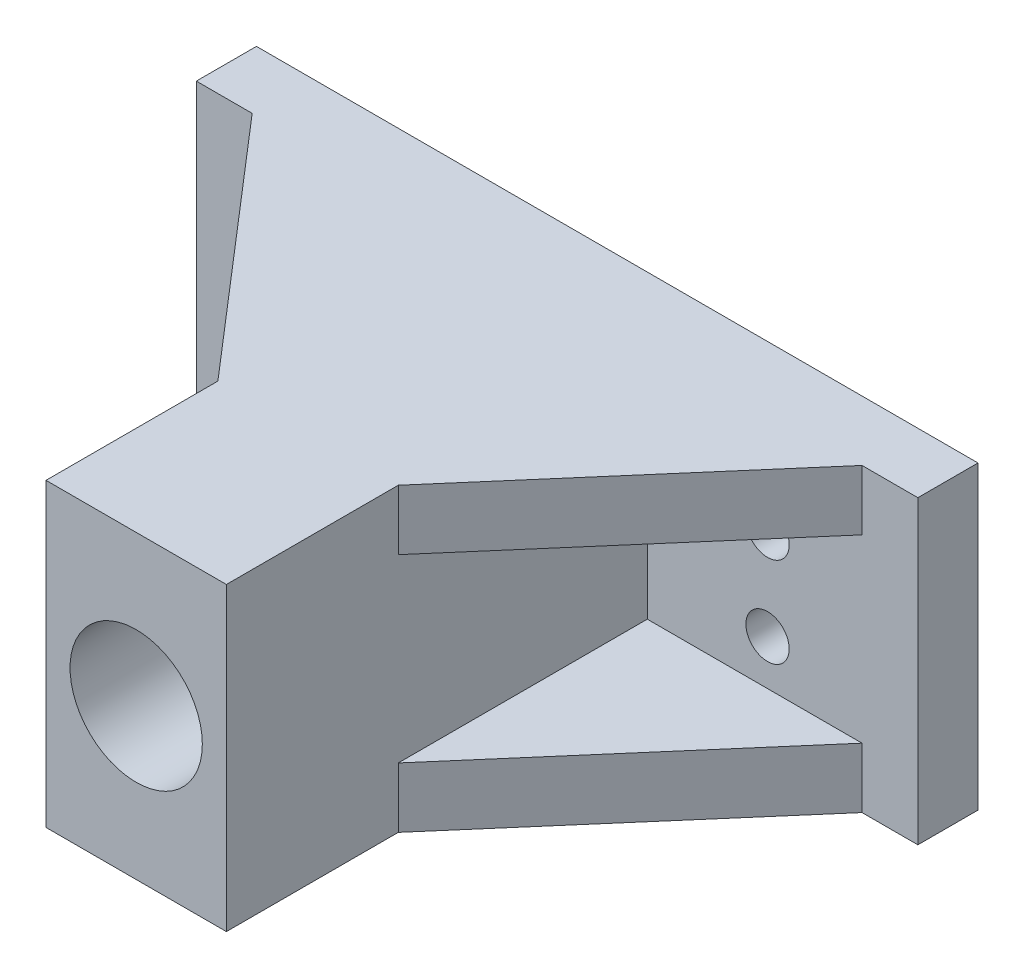
ISO-10303-21;
HEADER;
FILE_DESCRIPTION(('STEP AP214'),'2;1');
FILE_NAME('part.step','',(''),(''),'','','');
FILE_SCHEMA(('AUTOMOTIVE_DESIGN { 1 0 10303 214 1 1 1 1 }'));
ENDSEC;
DATA;
#1=APPLICATION_CONTEXT('core data for automotive mechanical design processes');
#2=APPLICATION_PROTOCOL_DEFINITION('international standard','automotive_design',2000,#1);
#3=PRODUCT_CONTEXT('',#1,'mechanical');
#4=PRODUCT('Part','Part','',(#3));
#5=PRODUCT_RELATED_PRODUCT_CATEGORY('part','',(#4));
#6=PRODUCT_DEFINITION_FORMATION('','',#4);
#7=PRODUCT_DEFINITION_CONTEXT('part definition',#1,'design');
#8=PRODUCT_DEFINITION('design','',#6,#7);
#9=PRODUCT_DEFINITION_SHAPE('','',#8);
#10=(LENGTH_UNIT() NAMED_UNIT(*) SI_UNIT(.MILLI.,.METRE.));
#11=(NAMED_UNIT(*) PLANE_ANGLE_UNIT() SI_UNIT($,.RADIAN.));
#12=(NAMED_UNIT(*) SI_UNIT($,.STERADIAN.) SOLID_ANGLE_UNIT());
#13=UNCERTAINTY_MEASURE_WITH_UNIT(LENGTH_MEASURE(1.E-05),#10,'distance_accuracy_value','');
#14=(GEOMETRIC_REPRESENTATION_CONTEXT(3) GLOBAL_UNCERTAINTY_ASSIGNED_CONTEXT((#13)) GLOBAL_UNIT_ASSIGNED_CONTEXT((#10,
#11,#12)) REPRESENTATION_CONTEXT('',''));
#15=CARTESIAN_POINT('',(0.,0.,0.));
#16=DIRECTION('',(0.,0.,1.));
#17=DIRECTION('',(1.,0.,0.));
#18=AXIS2_PLACEMENT_3D('',#15,#16,#17);
#19=CARTESIAN_POINT('',(0.,0.,5.));
#20=DIRECTION('',(0.,0.,1.));
#21=DIRECTION('',(1.,0.,0.));
#22=AXIS2_PLACEMENT_3D('',#19,#20,#21);
#23=PLANE('',#22);
#24=CARTESIAN_POINT('',(17.5,-3.75,5.));
#25=DIRECTION('',(0.,0.,1.));
#26=DIRECTION('',(1.,0.,0.));
#27=AXIS2_PLACEMENT_3D('',#24,#25,#26);
#28=CIRCLE('',#27,1.8);
#29=CARTESIAN_POINT('',(19.3,-3.75,5.));
#30=VERTEX_POINT('',#29);
#31=EDGE_CURVE('E196',#30,#30,#28,.T.);
#32=ORIENTED_EDGE('',*,*,#31,.F.);
#33=EDGE_LOOP('',(#32));
#34=FACE_BOUND('',#33,.T.);
#35=CARTESIAN_POINT('',(17.5,3.75,5.));
#36=DIRECTION('',(0.,0.,1.));
#37=DIRECTION('',(-1.,0.,0.));
#38=AXIS2_PLACEMENT_3D('',#35,#36,#37);
#39=CIRCLE('',#38,1.8);
#40=CARTESIAN_POINT('',(15.7,3.75,5.));
#41=VERTEX_POINT('',#40);
#42=EDGE_CURVE('E185',#41,#41,#39,.T.);
#43=ORIENTED_EDGE('',*,*,#42,.F.);
#44=EDGE_LOOP('',(#43));
#45=FACE_BOUND('',#44,.T.);
#46=DIRECTION('',(0.,1.,0.));
#47=VECTOR('',#46,1.);
#48=CARTESIAN_POINT('',(25.3552316545314,0.,5.));
#49=LINE('',#48,#47);
#50=CARTESIAN_POINT('',(25.3552316545314,-12.5,5.00000000000001));
#51=VERTEX_POINT('',#50);
#52=CARTESIAN_POINT('',(25.3552316545314,-7.5,5.));
#53=VERTEX_POINT('',#52);
#54=EDGE_CURVE('E219',#51,#53,#49,.T.);
#55=ORIENTED_EDGE('',*,*,#54,.F.);
#56=DIRECTION('',(1.,0.,0.));
#57=VECTOR('',#56,1.);
#58=CARTESIAN_POINT('',(-30.,-12.5,5.));
#59=LINE('',#58,#57);
#60=CARTESIAN_POINT('',(30.,-12.5,5.));
#61=VERTEX_POINT('',#60);
#62=EDGE_CURVE('E270',#51,#61,#59,.T.);
#63=ORIENTED_EDGE('',*,*,#62,.T.);
#64=DIRECTION('',(0.,1.,0.));
#65=VECTOR('',#64,1.);
#66=CARTESIAN_POINT('',(30.,7.50000000000001,5.));
#67=LINE('',#66,#65);
#68=CARTESIAN_POINT('',(30.,12.5,5.));
#69=VERTEX_POINT('',#68);
#70=EDGE_CURVE('E291',#61,#69,#67,.T.);
#71=ORIENTED_EDGE('',*,*,#70,.T.);
#72=DIRECTION('',(-1.,0.,0.));
#73=VECTOR('',#72,1.);
#74=CARTESIAN_POINT('',(-30.,12.5,5.));
#75=LINE('',#74,#73);
#76=CARTESIAN_POINT('',(25.3552316545314,12.5,5.00000000000001));
#77=VERTEX_POINT('',#76);
#78=EDGE_CURVE('E286',#69,#77,#75,.T.);
#79=ORIENTED_EDGE('',*,*,#78,.T.);
#80=DIRECTION('',(0.,-1.,0.));
#81=VECTOR('',#80,1.);
#82=CARTESIAN_POINT('',(25.3552316545314,0.,5.));
#83=LINE('',#82,#81);
#84=CARTESIAN_POINT('',(25.3552316545314,7.5,5.));
#85=VERTEX_POINT('',#84);
#86=EDGE_CURVE('E235',#85,#77,#83,.F.);
#87=ORIENTED_EDGE('',*,*,#86,.F.);
#88=DIRECTION('',(-1.,0.,0.));
#89=VECTOR('',#88,1.);
#90=CARTESIAN_POINT('',(0.,7.5,5.));
#91=LINE('',#90,#89);
#92=CARTESIAN_POINT('',(7.5,7.5,5.));
#93=VERTEX_POINT('',#92);
#94=EDGE_CURVE('E230',#85,#93,#91,.T.);
#95=ORIENTED_EDGE('',*,*,#94,.T.);
#96=DIRECTION('',(0.,1.,0.));
#97=VECTOR('',#96,1.);
#98=CARTESIAN_POINT('',(7.5,7.5,5.));
#99=LINE('',#98,#97);
#100=CARTESIAN_POINT('',(7.5,-7.5,5.));
#101=VERTEX_POINT('',#100);
#102=EDGE_CURVE('E43',#101,#93,#99,.T.);
#103=ORIENTED_EDGE('',*,*,#102,.F.);
#104=DIRECTION('',(1.,0.,0.));
#105=VECTOR('',#104,1.);
#106=CARTESIAN_POINT('',(0.,-7.5,5.));
#107=LINE('',#106,#105);
#108=EDGE_CURVE('E50',#101,#53,#107,.T.);
#109=ORIENTED_EDGE('',*,*,#108,.T.);
#110=EDGE_LOOP('',(#55,#63,#71,#79,#87,#95,#103,#109));
#111=FACE_BOUND('',#110,.T.);
#112=ADVANCED_FACE('F35',(#34,#45,#111),#23,.T.);
#113=CARTESIAN_POINT('',(-17.5,-3.75,5.));
#114=DIRECTION('',(0.,0.,1.));
#115=DIRECTION('',(-1.,0.,0.));
#116=AXIS2_PLACEMENT_3D('',#113,#114,#115);
#117=CIRCLE('',#116,1.8);
#118=CARTESIAN_POINT('',(-19.3,-3.75,5.));
#119=VERTEX_POINT('',#118);
#120=EDGE_CURVE('E190',#119,#119,#117,.T.);
#121=ORIENTED_EDGE('',*,*,#120,.F.);
#122=EDGE_LOOP('',(#121));
#123=FACE_BOUND('',#122,.T.);
#124=CARTESIAN_POINT('',(-17.5,3.75,5.));
#125=DIRECTION('',(0.,0.,1.));
#126=DIRECTION('',(1.,0.,0.));
#127=AXIS2_PLACEMENT_3D('',#124,#125,#126);
#128=CIRCLE('',#127,1.8);
#129=CARTESIAN_POINT('',(-15.7,3.75,5.));
#130=VERTEX_POINT('',#129);
#131=EDGE_CURVE('E189',#130,#130,#128,.T.);
#132=ORIENTED_EDGE('',*,*,#131,.F.);
#133=EDGE_LOOP('',(#132));
#134=FACE_BOUND('',#133,.T.);
#135=DIRECTION('',(0.,1.,0.));
#136=VECTOR('',#135,1.);
#137=CARTESIAN_POINT('',(-25.3552316545314,0.,5.));
#138=LINE('',#137,#136);
#139=CARTESIAN_POINT('',(-25.3552316545314,-7.5,5.));
#140=VERTEX_POINT('',#139);
#141=CARTESIAN_POINT('',(-25.3552316545314,-12.5,5.));
#142=VERTEX_POINT('',#141);
#143=EDGE_CURVE('E245',#140,#142,#138,.F.);
#144=ORIENTED_EDGE('',*,*,#143,.F.);
#145=DIRECTION('',(1.,0.,0.));
#146=VECTOR('',#145,1.);
#147=CARTESIAN_POINT('',(0.,-7.5,5.));
#148=LINE('',#147,#146);
#149=CARTESIAN_POINT('',(-7.5,-7.5,5.));
#150=VERTEX_POINT('',#149);
#151=EDGE_CURVE('E249',#140,#150,#148,.T.);
#152=ORIENTED_EDGE('',*,*,#151,.T.);
#153=DIRECTION('',(0.,-1.,0.));
#154=VECTOR('',#153,1.);
#155=CARTESIAN_POINT('',(-7.5,7.5,5.));
#156=LINE('',#155,#154);
#157=CARTESIAN_POINT('',(-7.5,7.5,5.));
#158=VERTEX_POINT('',#157);
#159=EDGE_CURVE('E300',#158,#150,#156,.T.);
#160=ORIENTED_EDGE('',*,*,#159,.F.);
#161=DIRECTION('',(-1.,0.,0.));
#162=VECTOR('',#161,1.);
#163=CARTESIAN_POINT('',(0.,7.5,5.));
#164=LINE('',#163,#162);
#165=CARTESIAN_POINT('',(-25.3552316545314,7.5,5.));
#166=VERTEX_POINT('',#165);
#167=EDGE_CURVE('E264',#158,#166,#164,.T.);
#168=ORIENTED_EDGE('',*,*,#167,.T.);
#169=DIRECTION('',(0.,-1.,0.));
#170=VECTOR('',#169,1.);
#171=CARTESIAN_POINT('',(-25.3552316545314,0.,5.));
#172=LINE('',#171,#170);
#173=CARTESIAN_POINT('',(-25.3552316545314,12.5,5.));
#174=VERTEX_POINT('',#173);
#175=EDGE_CURVE('E258',#174,#166,#172,.T.);
#176=ORIENTED_EDGE('',*,*,#175,.F.);
#177=CARTESIAN_POINT('',(-30.,12.5,5.));
#178=VERTEX_POINT('',#177);
#179=EDGE_CURVE('E280',#174,#178,#75,.T.);
#180=ORIENTED_EDGE('',*,*,#179,.T.);
#181=DIRECTION('',(0.,-1.,0.));
#182=VECTOR('',#181,1.);
#183=CARTESIAN_POINT('',(-30.,7.5,5.));
#184=LINE('',#183,#182);
#185=CARTESIAN_POINT('',(-30.,-12.5,5.));
#186=VERTEX_POINT('',#185);
#187=EDGE_CURVE('E296',#178,#186,#184,.T.);
#188=ORIENTED_EDGE('',*,*,#187,.T.);
#189=EDGE_CURVE('E274',#186,#142,#59,.T.);
#190=ORIENTED_EDGE('',*,*,#189,.T.);
#191=EDGE_LOOP('',(#144,#152,#160,#168,#176,#180,#188,#190));
#192=FACE_BOUND('',#191,.T.);
#193=ADVANCED_FACE('F333',(#123,#134,#192),#23,.T.);
#194=CARTESIAN_POINT('',(0.,0.,0.));
#195=DIRECTION('',(0.,0.,1.));
#196=DIRECTION('',(1.,0.,0.));
#197=AXIS2_PLACEMENT_3D('',#194,#195,#196);
#198=PLANE('',#197);
#199=CARTESIAN_POINT('',(-17.5,-3.75,0.));
#200=DIRECTION('',(0.,0.,1.));
#201=DIRECTION('',(-1.,0.,0.));
#202=AXIS2_PLACEMENT_3D('',#199,#200,#201);
#203=CIRCLE('',#202,1.8);
#204=CARTESIAN_POINT('',(-19.3,-3.75,0.));
#205=VERTEX_POINT('',#204);
#206=EDGE_CURVE('E186',#205,#205,#203,.T.);
#207=ORIENTED_EDGE('',*,*,#206,.T.);
#208=EDGE_LOOP('',(#207));
#209=FACE_BOUND('',#208,.T.);
#210=CARTESIAN_POINT('',(17.5,-3.75,0.));
#211=DIRECTION('',(0.,0.,1.));
#212=DIRECTION('',(1.,0.,0.));
#213=AXIS2_PLACEMENT_3D('',#210,#211,#212);
#214=CIRCLE('',#213,1.8);
#215=CARTESIAN_POINT('',(19.3,-3.75,0.));
#216=VERTEX_POINT('',#215);
#217=EDGE_CURVE('E193',#216,#216,#214,.T.);
#218=ORIENTED_EDGE('',*,*,#217,.T.);
#219=EDGE_LOOP('',(#218));
#220=FACE_BOUND('',#219,.T.);
#221=CARTESIAN_POINT('',(17.5,3.75,0.));
#222=DIRECTION('',(0.,0.,1.));
#223=DIRECTION('',(-1.,0.,0.));
#224=AXIS2_PLACEMENT_3D('',#221,#222,#223);
#225=CIRCLE('',#224,1.8);
#226=CARTESIAN_POINT('',(15.7,3.75,0.));
#227=VERTEX_POINT('',#226);
#228=EDGE_CURVE('E199',#227,#227,#225,.T.);
#229=ORIENTED_EDGE('',*,*,#228,.T.);
#230=EDGE_LOOP('',(#229));
#231=FACE_BOUND('',#230,.T.);
#232=CARTESIAN_POINT('',(-17.5,3.75,0.));
#233=DIRECTION('',(0.,0.,1.));
#234=DIRECTION('',(1.,0.,0.));
#235=AXIS2_PLACEMENT_3D('',#232,#233,#234);
#236=CIRCLE('',#235,1.8);
#237=CARTESIAN_POINT('',(-15.7,3.75,0.));
#238=VERTEX_POINT('',#237);
#239=EDGE_CURVE('E204',#238,#238,#236,.T.);
#240=ORIENTED_EDGE('',*,*,#239,.T.);
#241=EDGE_LOOP('',(#240));
#242=FACE_BOUND('',#241,.T.);
#243=DIRECTION('',(0.,1.,0.));
#244=VECTOR('',#243,1.);
#245=CARTESIAN_POINT('',(30.,7.50000000000001,0.));
#246=LINE('',#245,#244);
#247=CARTESIAN_POINT('',(30.,-12.5,0.));
#248=VERTEX_POINT('',#247);
#249=CARTESIAN_POINT('',(30.,12.5,0.));
#250=VERTEX_POINT('',#249);
#251=EDGE_CURVE('E294',#248,#250,#246,.T.);
#252=ORIENTED_EDGE('',*,*,#251,.F.);
#253=DIRECTION('',(1.,0.,0.));
#254=VECTOR('',#253,1.);
#255=CARTESIAN_POINT('',(-30.,-12.5,0.));
#256=LINE('',#255,#254);
#257=CARTESIAN_POINT('',(-30.,-12.5,0.));
#258=VERTEX_POINT('',#257);
#259=EDGE_CURVE('E271',#258,#248,#256,.T.);
#260=ORIENTED_EDGE('',*,*,#259,.F.);
#261=DIRECTION('',(0.,-1.,0.));
#262=VECTOR('',#261,1.);
#263=CARTESIAN_POINT('',(-30.,7.5,0.));
#264=LINE('',#263,#262);
#265=CARTESIAN_POINT('',(-30.,12.5,0.));
#266=VERTEX_POINT('',#265);
#267=EDGE_CURVE('E298',#266,#258,#264,.T.);
#268=ORIENTED_EDGE('',*,*,#267,.F.);
#269=DIRECTION('',(-1.,0.,0.));
#270=VECTOR('',#269,1.);
#271=CARTESIAN_POINT('',(-30.,12.5,0.));
#272=LINE('',#271,#270);
#273=EDGE_CURVE('E283',#250,#266,#272,.T.);
#274=ORIENTED_EDGE('',*,*,#273,.F.);
#275=EDGE_LOOP('',(#252,#260,#268,#274));
#276=FACE_BOUND('',#275,.T.);
#277=CARTESIAN_POINT('',(0.,0.,0.));
#278=DIRECTION('',(0.,0.,1.));
#279=DIRECTION('',(1.,0.,0.));
#280=AXIS2_PLACEMENT_3D('',#277,#278,#279);
#281=CIRCLE('',#280,5.5);
#282=CARTESIAN_POINT('',(5.5,0.,0.));
#283=VERTEX_POINT('',#282);
#284=EDGE_CURVE('E11',#283,#283,#281,.T.);
#285=ORIENTED_EDGE('',*,*,#284,.T.);
#286=EDGE_LOOP('',(#285));
#287=FACE_BOUND('',#286,.T.);
#288=ADVANCED_FACE('F37',(#209,#220,#231,#242,#276,#287),#198,.F.);
#289=CARTESIAN_POINT('',(0.,0.,0.));
#290=DIRECTION('',(0.,0.,1.));
#291=DIRECTION('',(1.,0.,0.));
#292=AXIS2_PLACEMENT_3D('',#289,#290,#291);
#293=CYLINDRICAL_SURFACE('',#292,5.5);
#294=ORIENTED_EDGE('',*,*,#284,.F.);
#295=EDGE_LOOP('',(#294));
#296=FACE_BOUND('',#295,.T.);
#297=CARTESIAN_POINT('',(0.,0.,40.));
#298=DIRECTION('',(0.,0.,1.));
#299=DIRECTION('',(1.,0.,0.));
#300=AXIS2_PLACEMENT_3D('',#297,#298,#299);
#301=CIRCLE('',#300,5.5);
#302=CARTESIAN_POINT('',(5.5,0.,40.));
#303=VERTEX_POINT('',#302);
#304=EDGE_CURVE('E178',#303,#303,#301,.T.);
#305=ORIENTED_EDGE('',*,*,#304,.T.);
#306=EDGE_LOOP('',(#305));
#307=FACE_BOUND('',#306,.T.);
#308=ADVANCED_FACE('F376',(#296,#307),#293,.F.);
#309=CARTESIAN_POINT('',(-7.5,7.5,30.));
#310=DIRECTION('',(1.,0.,0.));
#311=DIRECTION('',(0.,1.,0.));
#312=AXIS2_PLACEMENT_3D('',#309,#310,#311);
#313=PLANE('',#312);
#314=DIRECTION('',(0.,0.,-1.));
#315=VECTOR('',#314,1.);
#316=CARTESIAN_POINT('',(-7.5,-12.5,45.8113883008419));
#317=LINE('',#316,#315);
#318=CARTESIAN_POINT('',(-7.5,-12.5,40.));
#319=VERTEX_POINT('',#318);
#320=CARTESIAN_POINT('',(-7.49999999999998,-12.5,25.7076023988971));
#321=VERTEX_POINT('',#320);
#322=EDGE_CURVE('E161',#319,#321,#317,.T.);
#323=ORIENTED_EDGE('',*,*,#322,.F.);
#324=DIRECTION('',(0.,-1.,0.));
#325=VECTOR('',#324,1.);
#326=CARTESIAN_POINT('',(-7.5,12.5,40.));
#327=LINE('',#326,#325);
#328=CARTESIAN_POINT('',(-7.5,12.5,40.));
#329=VERTEX_POINT('',#328);
#330=EDGE_CURVE('E164',#329,#319,#327,.T.);
#331=ORIENTED_EDGE('',*,*,#330,.F.);
#332=DIRECTION('',(0.,0.,-1.));
#333=VECTOR('',#332,1.);
#334=CARTESIAN_POINT('',(-7.5,12.5,45.8113883008419));
#335=LINE('',#334,#333);
#336=CARTESIAN_POINT('',(-7.49999999999999,12.5,25.7076023988971));
#337=VERTEX_POINT('',#336);
#338=EDGE_CURVE('E149',#329,#337,#335,.T.);
#339=ORIENTED_EDGE('',*,*,#338,.T.);
#340=DIRECTION('',(0.,-1.,0.));
#341=VECTOR('',#340,1.);
#342=CARTESIAN_POINT('',(-7.5,7.5,25.7076023988971));
#343=LINE('',#342,#341);
#344=CARTESIAN_POINT('',(-7.5,7.5,25.7076023988971));
#345=VERTEX_POINT('',#344);
#346=EDGE_CURVE('E254',#337,#345,#343,.T.);
#347=ORIENTED_EDGE('',*,*,#346,.T.);
#348=DIRECTION('',(0.,0.,1.));
#349=VECTOR('',#348,1.);
#350=CARTESIAN_POINT('',(-7.5,7.5,30.));
#351=LINE('',#350,#349);
#352=EDGE_CURVE('E261',#158,#345,#351,.T.);
#353=ORIENTED_EDGE('',*,*,#352,.F.);
#354=ORIENTED_EDGE('',*,*,#159,.T.);
#355=DIRECTION('',(0.,0.,-1.));
#356=VECTOR('',#355,1.);
#357=CARTESIAN_POINT('',(-7.5,-7.5,30.));
#358=LINE('',#357,#356);
#359=CARTESIAN_POINT('',(-7.5,-7.5,25.7076023988971));
#360=VERTEX_POINT('',#359);
#361=EDGE_CURVE('E247',#360,#150,#358,.T.);
#362=ORIENTED_EDGE('',*,*,#361,.F.);
#363=DIRECTION('',(0.,1.,0.));
#364=VECTOR('',#363,1.);
#365=CARTESIAN_POINT('',(-7.5,7.5,25.7076023988971));
#366=LINE('',#365,#364);
#367=EDGE_CURVE('E241',#360,#321,#366,.F.);
#368=ORIENTED_EDGE('',*,*,#367,.T.);
#369=EDGE_LOOP('',(#323,#331,#339,#347,#353,#354,#362,#368));
#370=FACE_BOUND('',#369,.T.);
#371=ADVANCED_FACE('F165',(#370),#313,.F.);
#372=CARTESIAN_POINT('',(7.5,7.5,30.));
#373=DIRECTION('',(-1.,0.,0.));
#374=DIRECTION('',(0.,0.,1.));
#375=AXIS2_PLACEMENT_3D('',#372,#373,#374);
#376=PLANE('',#375);
#377=DIRECTION('',(0.,0.,-1.));
#378=VECTOR('',#377,1.);
#379=CARTESIAN_POINT('',(7.5,-12.5,45.8113883008419));
#380=LINE('',#379,#378);
#381=CARTESIAN_POINT('',(7.5,-12.5,40.));
#382=VERTEX_POINT('',#381);
#383=CARTESIAN_POINT('',(7.49999999999999,-12.5,25.7076023988971));
#384=VERTEX_POINT('',#383);
#385=EDGE_CURVE('E266',#382,#384,#380,.T.);
#386=ORIENTED_EDGE('',*,*,#385,.T.);
#387=DIRECTION('',(0.,1.,0.));
#388=VECTOR('',#387,1.);
#389=CARTESIAN_POINT('',(7.5,7.5,25.7076023988971));
#390=LINE('',#389,#388);
#391=CARTESIAN_POINT('',(7.5,-7.5,25.7076023988971));
#392=VERTEX_POINT('',#391);
#393=EDGE_CURVE('E58',#384,#392,#390,.T.);
#394=ORIENTED_EDGE('',*,*,#393,.T.);
#395=DIRECTION('',(0.,0.,1.));
#396=VECTOR('',#395,1.);
#397=CARTESIAN_POINT('',(7.5,-7.5,30.));
#398=LINE('',#397,#396);
#399=EDGE_CURVE('E213',#101,#392,#398,.T.);
#400=ORIENTED_EDGE('',*,*,#399,.F.);
#401=ORIENTED_EDGE('',*,*,#102,.T.);
#402=DIRECTION('',(0.,0.,-1.));
#403=VECTOR('',#402,1.);
#404=CARTESIAN_POINT('',(7.5,7.5,30.));
#405=LINE('',#404,#403);
#406=CARTESIAN_POINT('',(7.5,7.5,25.7076023988971));
#407=VERTEX_POINT('',#406);
#408=EDGE_CURVE('E225',#407,#93,#405,.T.);
#409=ORIENTED_EDGE('',*,*,#408,.F.);
#410=DIRECTION('',(0.,-1.,0.));
#411=VECTOR('',#410,1.);
#412=CARTESIAN_POINT('',(7.5,7.5,25.7076023988971));
#413=LINE('',#412,#411);
#414=CARTESIAN_POINT('',(7.49999999999999,12.5,25.7076023988971));
#415=VERTEX_POINT('',#414);
#416=EDGE_CURVE('E233',#407,#415,#413,.F.);
#417=ORIENTED_EDGE('',*,*,#416,.T.);
#418=DIRECTION('',(0.,0.,-1.));
#419=VECTOR('',#418,1.);
#420=CARTESIAN_POINT('',(7.5,12.5,45.8113883008419));
#421=LINE('',#420,#419);
#422=CARTESIAN_POINT('',(7.5,12.5,40.));
#423=VERTEX_POINT('',#422);
#424=EDGE_CURVE('E160',#423,#415,#421,.T.);
#425=ORIENTED_EDGE('',*,*,#424,.F.);
#426=DIRECTION('',(0.,1.,0.));
#427=VECTOR('',#426,1.);
#428=CARTESIAN_POINT('',(7.5,-12.5,40.));
#429=LINE('',#428,#427);
#430=EDGE_CURVE('E177',#382,#423,#429,.T.);
#431=ORIENTED_EDGE('',*,*,#430,.F.);
#432=EDGE_LOOP('',(#386,#394,#400,#401,#409,#417,#425,#431));
#433=FACE_BOUND('',#432,.T.);
#434=ADVANCED_FACE('F303',(#433),#376,.F.);
#435=CARTESIAN_POINT('',(-30.,7.5,0.));
#436=DIRECTION('',(-1.,0.,0.));
#437=DIRECTION('',(0.,0.,1.));
#438=AXIS2_PLACEMENT_3D('',#435,#436,#437);
#439=PLANE('',#438);
#440=DIRECTION('',(0.,0.,1.));
#441=VECTOR('',#440,1.);
#442=CARTESIAN_POINT('',(-30.,-12.5,0.));
#443=LINE('',#442,#441);
#444=EDGE_CURVE('E273',#258,#186,#443,.T.);
#445=ORIENTED_EDGE('',*,*,#444,.T.);
#446=ORIENTED_EDGE('',*,*,#187,.F.);
#447=DIRECTION('',(0.,0.,1.));
#448=VECTOR('',#447,1.);
#449=CARTESIAN_POINT('',(-30.,12.5,0.));
#450=LINE('',#449,#448);
#451=EDGE_CURVE('E288',#266,#178,#450,.T.);
#452=ORIENTED_EDGE('',*,*,#451,.F.);
#453=ORIENTED_EDGE('',*,*,#267,.T.);
#454=EDGE_LOOP('',(#445,#446,#452,#453));
#455=FACE_BOUND('',#454,.T.);
#456=ADVANCED_FACE('F328',(#455),#439,.T.);
#457=CARTESIAN_POINT('',(30.,7.50000000000001,0.));
#458=DIRECTION('',(1.,0.,0.));
#459=DIRECTION('',(0.,0.,-1.));
#460=AXIS2_PLACEMENT_3D('',#457,#458,#459);
#461=PLANE('',#460);
#462=ORIENTED_EDGE('',*,*,#251,.T.);
#463=DIRECTION('',(0.,0.,1.));
#464=VECTOR('',#463,1.);
#465=CARTESIAN_POINT('',(30.,12.5,0.));
#466=LINE('',#465,#464);
#467=EDGE_CURVE('E285',#250,#69,#466,.T.);
#468=ORIENTED_EDGE('',*,*,#467,.T.);
#469=ORIENTED_EDGE('',*,*,#70,.F.);
#470=DIRECTION('',(0.,0.,1.));
#471=VECTOR('',#470,1.);
#472=CARTESIAN_POINT('',(30.,-12.5,0.));
#473=LINE('',#472,#471);
#474=EDGE_CURVE('E277',#248,#61,#473,.T.);
#475=ORIENTED_EDGE('',*,*,#474,.F.);
#476=EDGE_LOOP('',(#462,#468,#469,#475));
#477=FACE_BOUND('',#476,.T.);
#478=ADVANCED_FACE('F319',(#477),#461,.T.);
#479=CARTESIAN_POINT('',(-30.,12.5,0.));
#480=DIRECTION('',(0.,1.,0.));
#481=DIRECTION('',(0.,0.,1.));
#482=AXIS2_PLACEMENT_3D('',#479,#480,#481);
#483=PLANE('',#482);
#484=ORIENTED_EDGE('',*,*,#424,.T.);
#485=DIRECTION('',(-0.653020400460944,0.,0.757340317546761));
#486=VECTOR('',#485,1.);
#487=CARTESIAN_POINT('',(25.3552316545314,12.5,5.));
#488=LINE('',#487,#486);
#489=EDGE_CURVE('E222',#77,#415,#488,.T.);
#490=ORIENTED_EDGE('',*,*,#489,.F.);
#491=ORIENTED_EDGE('',*,*,#78,.F.);
#492=ORIENTED_EDGE('',*,*,#467,.F.);
#493=ORIENTED_EDGE('',*,*,#273,.T.);
#494=ORIENTED_EDGE('',*,*,#451,.T.);
#495=ORIENTED_EDGE('',*,*,#179,.F.);
#496=DIRECTION('',(0.653020400460944,0.,0.757340317546761));
#497=VECTOR('',#496,1.);
#498=CARTESIAN_POINT('',(-25.3552316545314,12.5,5.));
#499=LINE('',#498,#497);
#500=EDGE_CURVE('E157',#174,#337,#499,.T.);
#501=ORIENTED_EDGE('',*,*,#500,.T.);
#502=ORIENTED_EDGE('',*,*,#338,.F.);
#503=DIRECTION('',(-1.,0.,0.));
#504=VECTOR('',#503,1.);
#505=CARTESIAN_POINT('',(7.5,12.5,40.));
#506=LINE('',#505,#504);
#507=EDGE_CURVE('E154',#423,#329,#506,.T.);
#508=ORIENTED_EDGE('',*,*,#507,.F.);
#509=EDGE_LOOP('',(#484,#490,#491,#492,#493,#494,#495,#501,#502,#508));
#510=FACE_BOUND('',#509,.T.);
#511=ADVANCED_FACE('F152',(#510),#483,.T.);
#512=CARTESIAN_POINT('',(-30.,-12.5,0.));
#513=DIRECTION('',(0.,-1.,0.));
#514=DIRECTION('',(1.,0.,0.));
#515=AXIS2_PLACEMENT_3D('',#512,#513,#514);
#516=PLANE('',#515);
#517=ORIENTED_EDGE('',*,*,#62,.F.);
#518=DIRECTION('',(-0.653020400460944,0.,0.757340317546761));
#519=VECTOR('',#518,1.);
#520=CARTESIAN_POINT('',(25.3552316545314,-12.5,5.));
#521=LINE('',#520,#519);
#522=EDGE_CURVE('E210',#51,#384,#521,.T.);
#523=ORIENTED_EDGE('',*,*,#522,.T.);
#524=ORIENTED_EDGE('',*,*,#385,.F.);
#525=DIRECTION('',(1.,0.,0.));
#526=VECTOR('',#525,1.);
#527=CARTESIAN_POINT('',(-7.5,-12.5,40.));
#528=LINE('',#527,#526);
#529=EDGE_CURVE('E171',#319,#382,#528,.T.);
#530=ORIENTED_EDGE('',*,*,#529,.F.);
#531=ORIENTED_EDGE('',*,*,#322,.T.);
#532=DIRECTION('',(0.653020400460944,0.,0.757340317546761));
#533=VECTOR('',#532,1.);
#534=CARTESIAN_POINT('',(-25.3552316545314,-12.5,5.));
#535=LINE('',#534,#533);
#536=EDGE_CURVE('E239',#142,#321,#535,.T.);
#537=ORIENTED_EDGE('',*,*,#536,.F.);
#538=ORIENTED_EDGE('',*,*,#189,.F.);
#539=ORIENTED_EDGE('',*,*,#444,.F.);
#540=ORIENTED_EDGE('',*,*,#259,.T.);
#541=ORIENTED_EDGE('',*,*,#474,.T.);
#542=EDGE_LOOP('',(#517,#523,#524,#530,#531,#537,#538,#539,#540,#541));
#543=FACE_BOUND('',#542,.T.);
#544=ADVANCED_FACE('F349',(#543),#516,.T.);
#545=CARTESIAN_POINT('',(-25.3552316545314,12.5,5.));
#546=DIRECTION('',(-0.757340317546761,0.,0.653020400460944));
#547=DIRECTION('',(0.653020400460944,0.,0.757340317546761));
#548=AXIS2_PLACEMENT_3D('',#545,#546,#547);
#549=PLANE('',#548);
#550=ORIENTED_EDGE('',*,*,#500,.F.);
#551=ORIENTED_EDGE('',*,*,#175,.T.);
#552=DIRECTION('',(0.653020400460944,0.,0.757340317546761));
#553=VECTOR('',#552,1.);
#554=CARTESIAN_POINT('',(-25.3552316545314,7.5,5.));
#555=LINE('',#554,#553);
#556=EDGE_CURVE('E252',#166,#345,#555,.T.);
#557=ORIENTED_EDGE('',*,*,#556,.T.);
#558=ORIENTED_EDGE('',*,*,#346,.F.);
#559=EDGE_LOOP('',(#550,#551,#557,#558));
#560=FACE_BOUND('',#559,.T.);
#561=ADVANCED_FACE('F338',(#560),#549,.T.);
#562=CARTESIAN_POINT('',(0.,7.5,15.));
#563=DIRECTION('',(0.,1.,0.));
#564=DIRECTION('',(0.,0.,1.));
#565=AXIS2_PLACEMENT_3D('',#562,#563,#564);
#566=PLANE('',#565);
#567=ORIENTED_EDGE('',*,*,#167,.F.);
#568=ORIENTED_EDGE('',*,*,#352,.T.);
#569=ORIENTED_EDGE('',*,*,#556,.F.);
#570=EDGE_LOOP('',(#567,#568,#569));
#571=FACE_BOUND('',#570,.T.);
#572=ADVANCED_FACE('F340',(#571),#566,.F.);
#573=CARTESIAN_POINT('',(-25.3552316545314,-12.5,5.));
#574=DIRECTION('',(0.757340317546761,0.,-0.653020400460944));
#575=DIRECTION('',(0.653020400460944,0.,0.757340317546761));
#576=AXIS2_PLACEMENT_3D('',#573,#574,#575);
#577=PLANE('',#576);
#578=DIRECTION('',(0.653020400460944,0.,0.757340317546761));
#579=VECTOR('',#578,1.);
#580=CARTESIAN_POINT('',(-25.3552316545314,-7.5,5.));
#581=LINE('',#580,#579);
#582=EDGE_CURVE('E238',#140,#360,#581,.T.);
#583=ORIENTED_EDGE('',*,*,#582,.F.);
#584=ORIENTED_EDGE('',*,*,#143,.T.);
#585=ORIENTED_EDGE('',*,*,#536,.T.);
#586=ORIENTED_EDGE('',*,*,#367,.F.);
#587=EDGE_LOOP('',(#583,#584,#585,#586));
#588=FACE_BOUND('',#587,.T.);
#589=ADVANCED_FACE('F346',(#588),#577,.F.);
#590=CARTESIAN_POINT('',(0.,-7.5,15.));
#591=DIRECTION('',(0.,-1.,0.));
#592=DIRECTION('',(1.,0.,0.));
#593=AXIS2_PLACEMENT_3D('',#590,#591,#592);
#594=PLANE('',#593);
#595=ORIENTED_EDGE('',*,*,#151,.F.);
#596=ORIENTED_EDGE('',*,*,#582,.T.);
#597=ORIENTED_EDGE('',*,*,#361,.T.);
#598=EDGE_LOOP('',(#595,#596,#597));
#599=FACE_BOUND('',#598,.T.);
#600=ADVANCED_FACE('F344',(#599),#594,.F.);
#601=CARTESIAN_POINT('',(25.3552316545314,12.5,5.));
#602=DIRECTION('',(-0.757340317546761,0.,-0.653020400460944));
#603=DIRECTION('',(-0.653020400460944,0.,0.757340317546761));
#604=AXIS2_PLACEMENT_3D('',#601,#602,#603);
#605=PLANE('',#604);
#606=DIRECTION('',(-0.653020400460944,0.,0.757340317546761));
#607=VECTOR('',#606,1.);
#608=CARTESIAN_POINT('',(25.3552316545314,7.5,5.));
#609=LINE('',#608,#607);
#610=EDGE_CURVE('E221',#85,#407,#609,.T.);
#611=ORIENTED_EDGE('',*,*,#610,.F.);
#612=ORIENTED_EDGE('',*,*,#86,.T.);
#613=ORIENTED_EDGE('',*,*,#489,.T.);
#614=ORIENTED_EDGE('',*,*,#416,.F.);
#615=EDGE_LOOP('',(#611,#612,#613,#614));
#616=FACE_BOUND('',#615,.T.);
#617=ADVANCED_FACE('F310',(#616),#605,.F.);
#618=CARTESIAN_POINT('',(0.,7.5,15.));
#619=DIRECTION('',(0.,1.,0.));
#620=DIRECTION('',(0.,0.,1.));
#621=AXIS2_PLACEMENT_3D('',#618,#619,#620);
#622=PLANE('',#621);
#623=ORIENTED_EDGE('',*,*,#94,.F.);
#624=ORIENTED_EDGE('',*,*,#610,.T.);
#625=ORIENTED_EDGE('',*,*,#408,.T.);
#626=EDGE_LOOP('',(#623,#624,#625));
#627=FACE_BOUND('',#626,.T.);
#628=ADVANCED_FACE('F308',(#627),#622,.F.);
#629=CARTESIAN_POINT('',(25.3552316545314,-12.5,5.));
#630=DIRECTION('',(0.757340317546761,0.,0.653020400460944));
#631=DIRECTION('',(-0.653020400460944,0.,0.757340317546761));
#632=AXIS2_PLACEMENT_3D('',#629,#630,#631);
#633=PLANE('',#632);
#634=ORIENTED_EDGE('',*,*,#522,.F.);
#635=ORIENTED_EDGE('',*,*,#54,.T.);
#636=DIRECTION('',(-0.653020400460944,0.,0.757340317546761));
#637=VECTOR('',#636,1.);
#638=CARTESIAN_POINT('',(25.3552316545314,-7.5,5.));
#639=LINE('',#638,#637);
#640=EDGE_CURVE('E207',#53,#392,#639,.T.);
#641=ORIENTED_EDGE('',*,*,#640,.T.);
#642=ORIENTED_EDGE('',*,*,#393,.F.);
#643=EDGE_LOOP('',(#634,#635,#641,#642));
#644=FACE_BOUND('',#643,.T.);
#645=ADVANCED_FACE('F352',(#644),#633,.T.);
#646=CARTESIAN_POINT('',(0.,-7.5,15.));
#647=DIRECTION('',(0.,-1.,0.));
#648=DIRECTION('',(1.,0.,0.));
#649=AXIS2_PLACEMENT_3D('',#646,#647,#648);
#650=PLANE('',#649);
#651=ORIENTED_EDGE('',*,*,#108,.F.);
#652=ORIENTED_EDGE('',*,*,#399,.T.);
#653=ORIENTED_EDGE('',*,*,#640,.F.);
#654=EDGE_LOOP('',(#651,#652,#653));
#655=FACE_BOUND('',#654,.T.);
#656=ADVANCED_FACE('F355',(#655),#650,.F.);
#657=CARTESIAN_POINT('',(-17.5,3.75,0.));
#658=DIRECTION('',(0.,0.,1.));
#659=DIRECTION('',(1.,0.,0.));
#660=AXIS2_PLACEMENT_3D('',#657,#658,#659);
#661=CYLINDRICAL_SURFACE('',#660,1.8);
#662=ORIENTED_EDGE('',*,*,#239,.F.);
#663=EDGE_LOOP('',(#662));
#664=FACE_BOUND('',#663,.T.);
#665=ORIENTED_EDGE('',*,*,#131,.T.);
#666=EDGE_LOOP('',(#665));
#667=FACE_BOUND('',#666,.T.);
#668=ADVANCED_FACE('F357',(#664,#667),#661,.F.);
#669=CARTESIAN_POINT('',(17.5,3.75,0.));
#670=DIRECTION('',(0.,0.,1.));
#671=DIRECTION('',(1.,0.,0.));
#672=AXIS2_PLACEMENT_3D('',#669,#670,#671);
#673=CYLINDRICAL_SURFACE('',#672,1.8);
#674=ORIENTED_EDGE('',*,*,#228,.F.);
#675=EDGE_LOOP('',(#674));
#676=FACE_BOUND('',#675,.T.);
#677=ORIENTED_EDGE('',*,*,#42,.T.);
#678=EDGE_LOOP('',(#677));
#679=FACE_BOUND('',#678,.T.);
#680=ADVANCED_FACE('F363',(#676,#679),#673,.F.);
#681=CARTESIAN_POINT('',(17.5,-3.75,0.));
#682=DIRECTION('',(0.,0.,1.));
#683=DIRECTION('',(1.,0.,0.));
#684=AXIS2_PLACEMENT_3D('',#681,#682,#683);
#685=CYLINDRICAL_SURFACE('',#684,1.8);
#686=ORIENTED_EDGE('',*,*,#217,.F.);
#687=EDGE_LOOP('',(#686));
#688=FACE_BOUND('',#687,.T.);
#689=ORIENTED_EDGE('',*,*,#31,.T.);
#690=EDGE_LOOP('',(#689));
#691=FACE_BOUND('',#690,.T.);
#692=ADVANCED_FACE('F453',(#688,#691),#685,.F.);
#693=CARTESIAN_POINT('',(-17.5,-3.75,0.));
#694=DIRECTION('',(0.,0.,1.));
#695=DIRECTION('',(1.,0.,0.));
#696=AXIS2_PLACEMENT_3D('',#693,#694,#695);
#697=CYLINDRICAL_SURFACE('',#696,1.8);
#698=ORIENTED_EDGE('',*,*,#206,.F.);
#699=EDGE_LOOP('',(#698));
#700=FACE_BOUND('',#699,.T.);
#701=ORIENTED_EDGE('',*,*,#120,.T.);
#702=EDGE_LOOP('',(#701));
#703=FACE_BOUND('',#702,.T.);
#704=ADVANCED_FACE('F463',(#700,#703),#697,.F.);
#705=CARTESIAN_POINT('',(0.,0.,40.));
#706=DIRECTION('',(0.,0.,1.));
#707=DIRECTION('',(1.,0.,0.));
#708=AXIS2_PLACEMENT_3D('',#705,#706,#707);
#709=PLANE('',#708);
#710=ORIENTED_EDGE('',*,*,#507,.T.);
#711=ORIENTED_EDGE('',*,*,#330,.T.);
#712=ORIENTED_EDGE('',*,*,#529,.T.);
#713=ORIENTED_EDGE('',*,*,#430,.T.);
#714=EDGE_LOOP('',(#710,#711,#712,#713));
#715=FACE_BOUND('',#714,.T.);
#716=ORIENTED_EDGE('',*,*,#304,.F.);
#717=EDGE_LOOP('',(#716));
#718=FACE_BOUND('',#717,.T.);
#719=ADVANCED_FACE('F174',(#715,#718),#709,.T.);
#720=CLOSED_SHELL('',(#112,#193,#288,#308,#371,#434,#456,#478,#511,#544,#561,#572,#589,#600,
#617,#628,#645,#656,#668,#680,#692,#704,#719));
#721=MANIFOLD_SOLID_BREP('B2',#720);
#722=ADVANCED_BREP_SHAPE_REPRESENTATION('',(#18,#721),#14);
#723=SHAPE_DEFINITION_REPRESENTATION(#9,#722);
ENDSEC;
END-ISO-10303-21;
